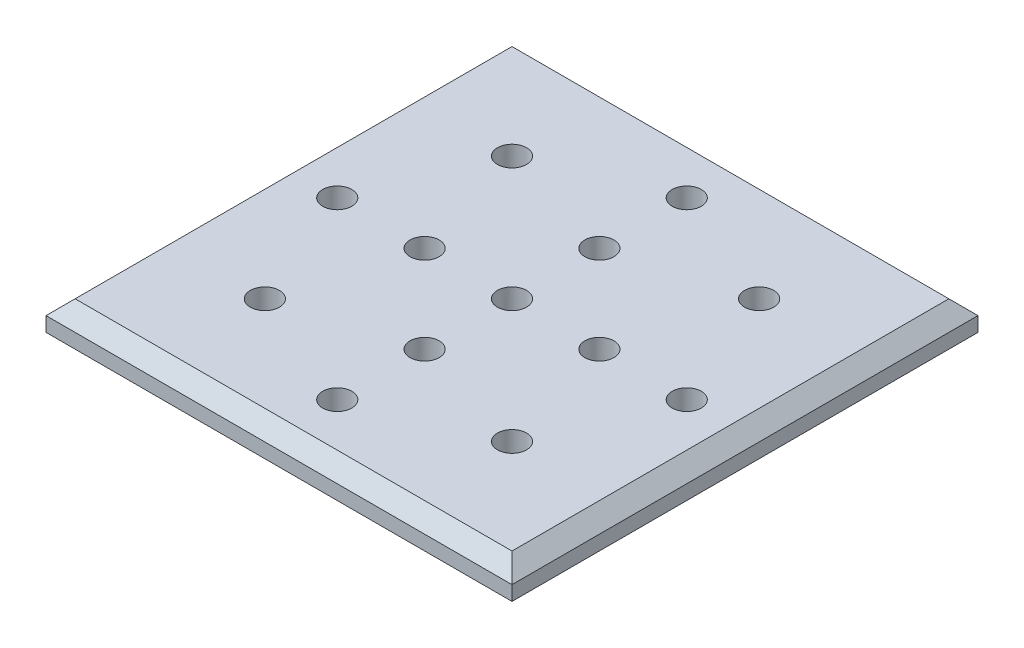
ISO-10303-21;
HEADER;
FILE_DESCRIPTION(('STEP AP214'),'2;1');
FILE_NAME('part.step','',(''),(''),'','','');
FILE_SCHEMA(('AUTOMOTIVE_DESIGN { 1 0 10303 214 1 1 1 1 }'));
ENDSEC;
DATA;
#1=APPLICATION_CONTEXT('core data for automotive mechanical design processes');
#2=APPLICATION_PROTOCOL_DEFINITION('international standard','automotive_design',2000,#1);
#3=PRODUCT_CONTEXT('',#1,'mechanical');
#4=PRODUCT('Part','Part','',(#3));
#5=PRODUCT_RELATED_PRODUCT_CATEGORY('part','',(#4));
#6=PRODUCT_DEFINITION_FORMATION('','',#4);
#7=PRODUCT_DEFINITION_CONTEXT('part definition',#1,'design');
#8=PRODUCT_DEFINITION('design','',#6,#7);
#9=PRODUCT_DEFINITION_SHAPE('','',#8);
#10=(LENGTH_UNIT() NAMED_UNIT(*) SI_UNIT(.MILLI.,.METRE.));
#11=(NAMED_UNIT(*) PLANE_ANGLE_UNIT() SI_UNIT($,.RADIAN.));
#12=(NAMED_UNIT(*) SI_UNIT($,.STERADIAN.) SOLID_ANGLE_UNIT());
#13=UNCERTAINTY_MEASURE_WITH_UNIT(LENGTH_MEASURE(1.E-05),#10,'distance_accuracy_value','');
#14=(GEOMETRIC_REPRESENTATION_CONTEXT(3) GLOBAL_UNCERTAINTY_ASSIGNED_CONTEXT((#13)) GLOBAL_UNIT_ASSIGNED_CONTEXT((#10,
#11,#12)) REPRESENTATION_CONTEXT('',''));
#15=CARTESIAN_POINT('',(0.,0.,0.));
#16=DIRECTION('',(0.,0.,1.));
#17=DIRECTION('',(1.,0.,0.));
#18=AXIS2_PLACEMENT_3D('',#15,#16,#17);
#19=CARTESIAN_POINT('',(50.8,9.525,50.8));
#20=DIRECTION('',(-1.,0.,0.));
#21=DIRECTION('',(0.,0.,1.));
#22=AXIS2_PLACEMENT_3D('',#19,#20,#21);
#23=PLANE('',#22);
#24=DIRECTION('',(0.,-1.,0.));
#25=VECTOR('',#24,1.);
#26=CARTESIAN_POINT('',(50.8,9.525,-50.8));
#27=LINE('',#26,#25);
#28=CARTESIAN_POINT('',(50.8,6.34999999999995,-50.8));
#29=VERTEX_POINT('',#28);
#30=CARTESIAN_POINT('',(50.8,3.175,-50.8));
#31=VERTEX_POINT('',#30);
#32=EDGE_CURVE('E176',#29,#31,#27,.T.);
#33=ORIENTED_EDGE('',*,*,#32,.F.);
#34=DIRECTION('',(0.,0.,1.));
#35=VECTOR('',#34,1.);
#36=CARTESIAN_POINT('',(50.8,6.34999999999995,50.8));
#37=LINE('',#36,#35);
#38=CARTESIAN_POINT('',(50.8,6.34999999999995,50.8));
#39=VERTEX_POINT('',#38);
#40=EDGE_CURVE('E11',#29,#39,#37,.T.);
#41=ORIENTED_EDGE('',*,*,#40,.T.);
#42=DIRECTION('',(0.,-1.,0.));
#43=VECTOR('',#42,1.);
#44=CARTESIAN_POINT('',(50.8,9.525,50.8));
#45=LINE('',#44,#43);
#46=CARTESIAN_POINT('',(50.8,3.175,50.8));
#47=VERTEX_POINT('',#46);
#48=EDGE_CURVE('E170',#39,#47,#45,.T.);
#49=ORIENTED_EDGE('',*,*,#48,.T.);
#50=DIRECTION('',(0.,0.,1.));
#51=VECTOR('',#50,1.);
#52=CARTESIAN_POINT('',(50.8,3.175,-50.8));
#53=LINE('',#52,#51);
#54=EDGE_CURVE('E161',#31,#47,#53,.T.);
#55=ORIENTED_EDGE('',*,*,#54,.F.);
#56=EDGE_LOOP('',(#33,#41,#49,#55));
#57=FACE_BOUND('',#56,.T.);
#58=ADVANCED_FACE('F33',(#57),#23,.F.);
#59=CARTESIAN_POINT('',(-50.8,9.525,-50.8));
#60=DIRECTION('',(0.,0.,1.));
#61=DIRECTION('',(1.,0.,0.));
#62=AXIS2_PLACEMENT_3D('',#59,#60,#61);
#63=PLANE('',#62);
#64=DIRECTION('',(0.,-1.,0.));
#65=VECTOR('',#64,1.);
#66=CARTESIAN_POINT('',(-50.8,9.525,-50.8));
#67=LINE('',#66,#65);
#68=CARTESIAN_POINT('',(-50.8,6.34999999999995,-50.8));
#69=VERTEX_POINT('',#68);
#70=CARTESIAN_POINT('',(-50.8,3.175,-50.8));
#71=VERTEX_POINT('',#70);
#72=EDGE_CURVE('E174',#69,#71,#67,.T.);
#73=ORIENTED_EDGE('',*,*,#72,.F.);
#74=DIRECTION('',(1.,0.,0.));
#75=VECTOR('',#74,1.);
#76=CARTESIAN_POINT('',(-50.8,6.34999999999995,-50.8));
#77=LINE('',#76,#75);
#78=EDGE_CURVE('E42',#69,#29,#77,.T.);
#79=ORIENTED_EDGE('',*,*,#78,.T.);
#80=ORIENTED_EDGE('',*,*,#32,.T.);
#81=DIRECTION('',(1.,0.,0.));
#82=VECTOR('',#81,1.);
#83=CARTESIAN_POINT('',(-50.8,3.175,-50.8));
#84=LINE('',#83,#82);
#85=EDGE_CURVE('E155',#71,#31,#84,.T.);
#86=ORIENTED_EDGE('',*,*,#85,.F.);
#87=EDGE_LOOP('',(#73,#79,#80,#86));
#88=FACE_BOUND('',#87,.T.);
#89=ADVANCED_FACE('F239',(#88),#63,.F.);
#90=CARTESIAN_POINT('',(-50.8,9.525,50.8));
#91=DIRECTION('',(1.,0.,0.));
#92=DIRECTION('',(0.,0.,-1.));
#93=AXIS2_PLACEMENT_3D('',#90,#91,#92);
#94=PLANE('',#93);
#95=DIRECTION('',(0.,-1.,0.));
#96=VECTOR('',#95,1.);
#97=CARTESIAN_POINT('',(-50.8,9.525,50.8));
#98=LINE('',#97,#96);
#99=CARTESIAN_POINT('',(-50.8,6.34999999999995,50.8));
#100=VERTEX_POINT('',#99);
#101=CARTESIAN_POINT('',(-50.8,3.175,50.8));
#102=VERTEX_POINT('',#101);
#103=EDGE_CURVE('E172',#100,#102,#98,.T.);
#104=ORIENTED_EDGE('',*,*,#103,.F.);
#105=DIRECTION('',(0.,0.,-1.));
#106=VECTOR('',#105,1.);
#107=CARTESIAN_POINT('',(-50.8,6.34999999999995,50.8));
#108=LINE('',#107,#106);
#109=EDGE_CURVE('E57',#100,#69,#108,.T.);
#110=ORIENTED_EDGE('',*,*,#109,.T.);
#111=ORIENTED_EDGE('',*,*,#72,.T.);
#112=DIRECTION('',(0.,0.,-1.));
#113=VECTOR('',#112,1.);
#114=CARTESIAN_POINT('',(-50.8,3.175,50.8));
#115=LINE('',#114,#113);
#116=EDGE_CURVE('E167',#102,#71,#115,.T.);
#117=ORIENTED_EDGE('',*,*,#116,.F.);
#118=EDGE_LOOP('',(#104,#110,#111,#117));
#119=FACE_BOUND('',#118,.T.);
#120=ADVANCED_FACE('F233',(#119),#94,.F.);
#121=CARTESIAN_POINT('',(-50.8,9.525,50.8));
#122=DIRECTION('',(0.,0.,-1.));
#123=DIRECTION('',(-1.,0.,0.));
#124=AXIS2_PLACEMENT_3D('',#121,#122,#123);
#125=PLANE('',#124);
#126=ORIENTED_EDGE('',*,*,#48,.F.);
#127=DIRECTION('',(-1.,0.,0.));
#128=VECTOR('',#127,1.);
#129=CARTESIAN_POINT('',(-50.8,6.34999999999995,50.8));
#130=LINE('',#129,#128);
#131=EDGE_CURVE('E187',#39,#100,#130,.T.);
#132=ORIENTED_EDGE('',*,*,#131,.T.);
#133=ORIENTED_EDGE('',*,*,#103,.T.);
#134=DIRECTION('',(-1.,0.,0.));
#135=VECTOR('',#134,1.);
#136=CARTESIAN_POINT('',(50.8,3.175,50.8));
#137=LINE('',#136,#135);
#138=EDGE_CURVE('E164',#47,#102,#137,.T.);
#139=ORIENTED_EDGE('',*,*,#138,.F.);
#140=EDGE_LOOP('',(#126,#132,#133,#139));
#141=FACE_BOUND('',#140,.T.);
#142=ADVANCED_FACE('F217',(#141),#125,.F.);
#143=CARTESIAN_POINT('',(0.,9.525,0.));
#144=DIRECTION('',(0.,-1.,0.));
#145=DIRECTION('',(0.,0.,-1.));
#146=AXIS2_PLACEMENT_3D('',#143,#144,#145);
#147=PLANE('',#146);
#148=CARTESIAN_POINT('',(0.,9.525,-19.05));
#149=DIRECTION('',(0.,-1.,0.));
#150=DIRECTION('',(0.,0.,-1.));
#151=AXIS2_PLACEMENT_3D('',#148,#149,#150);
#152=CIRCLE('',#151,3.175);
#153=CARTESIAN_POINT('',(0.,9.525,-22.225));
#154=VERTEX_POINT('',#153);
#155=EDGE_CURVE('E144',#154,#154,#152,.F.);
#156=ORIENTED_EDGE('',*,*,#155,.F.);
#157=EDGE_LOOP('',(#156));
#158=FACE_BOUND('',#157,.T.);
#159=CARTESIAN_POINT('',(26.9407683632074,9.525,26.9407683632075));
#160=DIRECTION('',(0.,-1.,0.));
#161=DIRECTION('',(0.,0.,-1.));
#162=AXIS2_PLACEMENT_3D('',#159,#160,#161);
#163=CIRCLE('',#162,3.175);
#164=CARTESIAN_POINT('',(26.9407683632074,9.525,23.7657683632075));
#165=VERTEX_POINT('',#164);
#166=EDGE_CURVE('E490',#165,#165,#163,.F.);
#167=ORIENTED_EDGE('',*,*,#166,.F.);
#168=EDGE_LOOP('',(#167));
#169=FACE_BOUND('',#168,.T.);
#170=CARTESIAN_POINT('',(0.,9.525,38.1));
#171=DIRECTION('',(0.,-1.,0.));
#172=DIRECTION('',(0.,0.,-1.));
#173=AXIS2_PLACEMENT_3D('',#170,#171,#172);
#174=CIRCLE('',#173,3.17499999999994);
#175=CARTESIAN_POINT('',(0.,9.525,34.9250000000001));
#176=VERTEX_POINT('',#175);
#177=EDGE_CURVE('E492',#176,#176,#174,.F.);
#178=ORIENTED_EDGE('',*,*,#177,.F.);
#179=EDGE_LOOP('',(#178));
#180=FACE_BOUND('',#179,.T.);
#181=CARTESIAN_POINT('',(-26.9407683632074,9.525,26.9407683632074));
#182=DIRECTION('',(0.,-1.,0.));
#183=DIRECTION('',(0.,0.,-1.));
#184=AXIS2_PLACEMENT_3D('',#181,#182,#183);
#185=CIRCLE('',#184,3.17500000000005);
#186=CARTESIAN_POINT('',(-26.9407683632074,9.525,23.7657683632073));
#187=VERTEX_POINT('',#186);
#188=EDGE_CURVE('E496',#187,#187,#185,.F.);
#189=ORIENTED_EDGE('',*,*,#188,.F.);
#190=EDGE_LOOP('',(#189));
#191=FACE_BOUND('',#190,.T.);
#192=CARTESIAN_POINT('',(-19.05,9.525,0.));
#193=DIRECTION('',(0.,-1.,0.));
#194=DIRECTION('',(0.,0.,-1.));
#195=AXIS2_PLACEMENT_3D('',#192,#193,#194);
#196=CIRCLE('',#195,3.175);
#197=CARTESIAN_POINT('',(-19.05,9.525,-3.175));
#198=VERTEX_POINT('',#197);
#199=EDGE_CURVE('E501',#198,#198,#196,.F.);
#200=ORIENTED_EDGE('',*,*,#199,.F.);
#201=EDGE_LOOP('',(#200));
#202=FACE_BOUND('',#201,.T.);
#203=CARTESIAN_POINT('',(0.,9.525,19.05));
#204=DIRECTION('',(0.,-1.,0.));
#205=DIRECTION('',(0.,0.,-1.));
#206=AXIS2_PLACEMENT_3D('',#203,#204,#205);
#207=CIRCLE('',#206,3.175);
#208=CARTESIAN_POINT('',(0.,9.525,15.875));
#209=VERTEX_POINT('',#208);
#210=EDGE_CURVE('E504',#209,#209,#207,.F.);
#211=ORIENTED_EDGE('',*,*,#210,.F.);
#212=EDGE_LOOP('',(#211));
#213=FACE_BOUND('',#212,.T.);
#214=CARTESIAN_POINT('',(38.1,9.525,0.));
#215=DIRECTION('',(0.,-1.,0.));
#216=DIRECTION('',(0.,0.,-1.));
#217=AXIS2_PLACEMENT_3D('',#214,#215,#216);
#218=CIRCLE('',#217,3.175);
#219=CARTESIAN_POINT('',(38.1,9.525,-3.175));
#220=VERTEX_POINT('',#219);
#221=EDGE_CURVE('E507',#220,#220,#218,.F.);
#222=ORIENTED_EDGE('',*,*,#221,.F.);
#223=EDGE_LOOP('',(#222));
#224=FACE_BOUND('',#223,.T.);
#225=CARTESIAN_POINT('',(19.05,9.525,0.));
#226=DIRECTION('',(0.,-1.,0.));
#227=DIRECTION('',(0.,0.,-1.));
#228=AXIS2_PLACEMENT_3D('',#225,#226,#227);
#229=CIRCLE('',#228,3.175);
#230=CARTESIAN_POINT('',(19.05,9.525,-3.175));
#231=VERTEX_POINT('',#230);
#232=EDGE_CURVE('E510',#231,#231,#229,.F.);
#233=ORIENTED_EDGE('',*,*,#232,.F.);
#234=EDGE_LOOP('',(#233));
#235=FACE_BOUND('',#234,.T.);
#236=CARTESIAN_POINT('',(-38.1,9.525,0.));
#237=DIRECTION('',(0.,-1.,0.));
#238=DIRECTION('',(0.,0.,-1.));
#239=AXIS2_PLACEMENT_3D('',#236,#237,#238);
#240=CIRCLE('',#239,3.1749999999999);
#241=CARTESIAN_POINT('',(-38.1,9.525,-3.1749999999999));
#242=VERTEX_POINT('',#241);
#243=EDGE_CURVE('E513',#242,#242,#240,.F.);
#244=ORIENTED_EDGE('',*,*,#243,.F.);
#245=EDGE_LOOP('',(#244));
#246=FACE_BOUND('',#245,.T.);
#247=CARTESIAN_POINT('',(-26.9407683632077,9.525,-26.9407683632075));
#248=DIRECTION('',(0.,-1.,0.));
#249=DIRECTION('',(0.,0.,-1.));
#250=AXIS2_PLACEMENT_3D('',#247,#248,#249);
#251=CIRCLE('',#250,3.17499999999972);
#252=CARTESIAN_POINT('',(-26.9407683632077,9.525,-30.1157683632072));
#253=VERTEX_POINT('',#252);
#254=EDGE_CURVE('E516',#253,#253,#251,.F.);
#255=ORIENTED_EDGE('',*,*,#254,.F.);
#256=EDGE_LOOP('',(#255));
#257=FACE_BOUND('',#256,.T.);
#258=CARTESIAN_POINT('',(-3.82545595598378E-13,9.525,-38.1000000000002));
#259=DIRECTION('',(0.,-1.,0.));
#260=DIRECTION('',(0.,0.,-1.));
#261=AXIS2_PLACEMENT_3D('',#258,#259,#260);
#262=CIRCLE('',#261,3.1749999999996);
#263=CARTESIAN_POINT('',(-3.82545595598378E-13,9.525,-41.2749999999998));
#264=VERTEX_POINT('',#263);
#265=EDGE_CURVE('E519',#264,#264,#262,.F.);
#266=ORIENTED_EDGE('',*,*,#265,.F.);
#267=EDGE_LOOP('',(#266));
#268=FACE_BOUND('',#267,.T.);
#269=CARTESIAN_POINT('',(26.9407683632071,9.525,-26.940768363208));
#270=DIRECTION('',(0.,-1.,0.));
#271=DIRECTION('',(0.,0.,-1.));
#272=AXIS2_PLACEMENT_3D('',#269,#270,#271);
#273=CIRCLE('',#272,3.17499999999958);
#274=CARTESIAN_POINT('',(26.9407683632071,9.525,-30.1157683632075));
#275=VERTEX_POINT('',#274);
#276=EDGE_CURVE('E522',#275,#275,#273,.F.);
#277=ORIENTED_EDGE('',*,*,#276,.F.);
#278=EDGE_LOOP('',(#277));
#279=FACE_BOUND('',#278,.T.);
#280=CARTESIAN_POINT('',(0.,9.525,0.));
#281=DIRECTION('',(0.,-1.,0.));
#282=DIRECTION('',(0.,0.,-1.));
#283=AXIS2_PLACEMENT_3D('',#280,#281,#282);
#284=CIRCLE('',#283,3.175);
#285=CARTESIAN_POINT('',(0.,9.525,-3.175));
#286=VERTEX_POINT('',#285);
#287=EDGE_CURVE('E525',#286,#286,#284,.F.);
#288=ORIENTED_EDGE('',*,*,#287,.F.);
#289=EDGE_LOOP('',(#288));
#290=FACE_BOUND('',#289,.T.);
#291=DIRECTION('',(0.,0.,1.));
#292=VECTOR('',#291,1.);
#293=CARTESIAN_POINT('',(-47.625,9.525,0.));
#294=LINE('',#293,#292);
#295=CARTESIAN_POINT('',(-47.625,9.525,-47.625));
#296=VERTEX_POINT('',#295);
#297=CARTESIAN_POINT('',(-47.625,9.525,47.625));
#298=VERTEX_POINT('',#297);
#299=EDGE_CURVE('E182',#296,#298,#294,.T.);
#300=ORIENTED_EDGE('',*,*,#299,.T.);
#301=DIRECTION('',(1.,0.,0.));
#302=VECTOR('',#301,1.);
#303=CARTESIAN_POINT('',(0.,9.525,47.625));
#304=LINE('',#303,#302);
#305=CARTESIAN_POINT('',(47.625,9.525,47.625));
#306=VERTEX_POINT('',#305);
#307=EDGE_CURVE('E184',#298,#306,#304,.T.);
#308=ORIENTED_EDGE('',*,*,#307,.T.);
#309=DIRECTION('',(0.,0.,-1.));
#310=VECTOR('',#309,1.);
#311=CARTESIAN_POINT('',(47.625,9.525,0.));
#312=LINE('',#311,#310);
#313=CARTESIAN_POINT('',(47.625,9.525,-47.625));
#314=VERTEX_POINT('',#313);
#315=EDGE_CURVE('E178',#306,#314,#312,.T.);
#316=ORIENTED_EDGE('',*,*,#315,.T.);
#317=DIRECTION('',(-1.,0.,0.));
#318=VECTOR('',#317,1.);
#319=CARTESIAN_POINT('',(0.,9.525,-47.625));
#320=LINE('',#319,#318);
#321=EDGE_CURVE('E180',#314,#296,#320,.T.);
#322=ORIENTED_EDGE('',*,*,#321,.T.);
#323=EDGE_LOOP('',(#300,#308,#316,#322));
#324=FACE_BOUND('',#323,.T.);
#325=ADVANCED_FACE('F222',(#158,#169,#180,#191,#202,#213,#224,#235,#246,#257,#268,#279,#290,
#324),#147,.F.);
#326=CARTESIAN_POINT('',(0.,3.175,0.));
#327=DIRECTION('',(0.,-1.,0.));
#328=DIRECTION('',(0.,0.,-1.));
#329=AXIS2_PLACEMENT_3D('',#326,#327,#328);
#330=PLANE('',#329);
#331=DIRECTION('',(1.,0.,0.));
#332=VECTOR('',#331,1.);
#333=CARTESIAN_POINT('',(-47.498,3.175,-47.498));
#334=LINE('',#333,#332);
#335=CARTESIAN_POINT('',(-47.498,3.175,-47.498));
#336=VERTEX_POINT('',#335);
#337=CARTESIAN_POINT('',(47.498,3.175,-47.498));
#338=VERTEX_POINT('',#337);
#339=EDGE_CURVE('E123',#336,#338,#334,.T.);
#340=ORIENTED_EDGE('',*,*,#339,.F.);
#341=DIRECTION('',(0.,0.,-1.));
#342=VECTOR('',#341,1.);
#343=CARTESIAN_POINT('',(-47.498,3.175,47.498));
#344=LINE('',#343,#342);
#345=CARTESIAN_POINT('',(-47.498,3.175,47.498));
#346=VERTEX_POINT('',#345);
#347=EDGE_CURVE('E133',#346,#336,#344,.T.);
#348=ORIENTED_EDGE('',*,*,#347,.F.);
#349=DIRECTION('',(-1.,0.,0.));
#350=VECTOR('',#349,1.);
#351=CARTESIAN_POINT('',(47.498,3.175,47.498));
#352=LINE('',#351,#350);
#353=CARTESIAN_POINT('',(47.498,3.175,47.498));
#354=VERTEX_POINT('',#353);
#355=EDGE_CURVE('E115',#354,#346,#352,.T.);
#356=ORIENTED_EDGE('',*,*,#355,.F.);
#357=DIRECTION('',(0.,0.,1.));
#358=VECTOR('',#357,1.);
#359=CARTESIAN_POINT('',(47.498,3.175,-47.498));
#360=LINE('',#359,#358);
#361=EDGE_CURVE('E130',#338,#354,#360,.T.);
#362=ORIENTED_EDGE('',*,*,#361,.F.);
#363=EDGE_LOOP('',(#340,#348,#356,#362));
#364=FACE_BOUND('',#363,.T.);
#365=ORIENTED_EDGE('',*,*,#85,.T.);
#366=ORIENTED_EDGE('',*,*,#54,.T.);
#367=ORIENTED_EDGE('',*,*,#138,.T.);
#368=ORIENTED_EDGE('',*,*,#116,.T.);
#369=EDGE_LOOP('',(#365,#366,#367,#368));
#370=FACE_BOUND('',#369,.T.);
#371=ADVANCED_FACE('F128',(#364,#370),#330,.T.);
#372=CARTESIAN_POINT('',(47.498,3.175,-47.498));
#373=DIRECTION('',(1.,0.,0.));
#374=DIRECTION('',(0.,0.,-1.));
#375=AXIS2_PLACEMENT_3D('',#372,#373,#374);
#376=PLANE('',#375);
#377=DIRECTION('',(0.,0.,1.));
#378=VECTOR('',#377,1.);
#379=CARTESIAN_POINT('',(47.498,0.,-47.498));
#380=LINE('',#379,#378);
#381=CARTESIAN_POINT('',(47.498,0.,-47.498));
#382=VERTEX_POINT('',#381);
#383=CARTESIAN_POINT('',(47.498,0.,47.498));
#384=VERTEX_POINT('',#383);
#385=EDGE_CURVE('E149',#382,#384,#380,.T.);
#386=ORIENTED_EDGE('',*,*,#385,.F.);
#387=DIRECTION('',(0.,-1.,0.));
#388=VECTOR('',#387,1.);
#389=CARTESIAN_POINT('',(47.498,3.175,-47.498));
#390=LINE('',#389,#388);
#391=EDGE_CURVE('E137',#338,#382,#390,.T.);
#392=ORIENTED_EDGE('',*,*,#391,.F.);
#393=ORIENTED_EDGE('',*,*,#361,.T.);
#394=DIRECTION('',(0.,-1.,0.));
#395=VECTOR('',#394,1.);
#396=CARTESIAN_POINT('',(47.498,3.175,47.498));
#397=LINE('',#396,#395);
#398=EDGE_CURVE('E111',#354,#384,#397,.T.);
#399=ORIENTED_EDGE('',*,*,#398,.T.);
#400=EDGE_LOOP('',(#386,#392,#393,#399));
#401=FACE_BOUND('',#400,.T.);
#402=ADVANCED_FACE('F136',(#401),#376,.T.);
#403=CARTESIAN_POINT('',(-47.498,3.175,-47.498));
#404=DIRECTION('',(0.,0.,-1.));
#405=DIRECTION('',(-1.,0.,0.));
#406=AXIS2_PLACEMENT_3D('',#403,#404,#405);
#407=PLANE('',#406);
#408=DIRECTION('',(1.,0.,0.));
#409=VECTOR('',#408,1.);
#410=CARTESIAN_POINT('',(-47.498,0.,-47.498));
#411=LINE('',#410,#409);
#412=CARTESIAN_POINT('',(-47.498,0.,-47.498));
#413=VERTEX_POINT('',#412);
#414=EDGE_CURVE('E138',#413,#382,#411,.T.);
#415=ORIENTED_EDGE('',*,*,#414,.F.);
#416=DIRECTION('',(0.,-1.,0.));
#417=VECTOR('',#416,1.);
#418=CARTESIAN_POINT('',(-47.498,3.175,-47.498));
#419=LINE('',#418,#417);
#420=EDGE_CURVE('E156',#336,#413,#419,.T.);
#421=ORIENTED_EDGE('',*,*,#420,.F.);
#422=ORIENTED_EDGE('',*,*,#339,.T.);
#423=ORIENTED_EDGE('',*,*,#391,.T.);
#424=EDGE_LOOP('',(#415,#421,#422,#423));
#425=FACE_BOUND('',#424,.T.);
#426=ADVANCED_FACE('F293',(#425),#407,.T.);
#427=CARTESIAN_POINT('',(-47.498,3.175,47.498));
#428=DIRECTION('',(-1.,0.,0.));
#429=DIRECTION('',(0.,0.,1.));
#430=AXIS2_PLACEMENT_3D('',#427,#428,#429);
#431=PLANE('',#430);
#432=DIRECTION('',(0.,0.,-1.));
#433=VECTOR('',#432,1.);
#434=CARTESIAN_POINT('',(-47.498,0.,47.498));
#435=LINE('',#434,#433);
#436=CARTESIAN_POINT('',(-47.498,0.,47.498));
#437=VERTEX_POINT('',#436);
#438=EDGE_CURVE('E141',#437,#413,#435,.T.);
#439=ORIENTED_EDGE('',*,*,#438,.F.);
#440=DIRECTION('',(0.,-1.,0.));
#441=VECTOR('',#440,1.);
#442=CARTESIAN_POINT('',(-47.498,3.175,47.498));
#443=LINE('',#442,#441);
#444=EDGE_CURVE('E122',#346,#437,#443,.T.);
#445=ORIENTED_EDGE('',*,*,#444,.F.);
#446=ORIENTED_EDGE('',*,*,#347,.T.);
#447=ORIENTED_EDGE('',*,*,#420,.T.);
#448=EDGE_LOOP('',(#439,#445,#446,#447));
#449=FACE_BOUND('',#448,.T.);
#450=ADVANCED_FACE('F263',(#449),#431,.T.);
#451=CARTESIAN_POINT('',(47.498,3.175,47.498));
#452=DIRECTION('',(0.,0.,1.));
#453=DIRECTION('',(1.,0.,0.));
#454=AXIS2_PLACEMENT_3D('',#451,#452,#453);
#455=PLANE('',#454);
#456=DIRECTION('',(-1.,0.,0.));
#457=VECTOR('',#456,1.);
#458=CARTESIAN_POINT('',(47.498,0.,47.498));
#459=LINE('',#458,#457);
#460=EDGE_CURVE('E117',#384,#437,#459,.T.);
#461=ORIENTED_EDGE('',*,*,#460,.F.);
#462=ORIENTED_EDGE('',*,*,#398,.F.);
#463=ORIENTED_EDGE('',*,*,#355,.T.);
#464=ORIENTED_EDGE('',*,*,#444,.T.);
#465=EDGE_LOOP('',(#461,#462,#463,#464));
#466=FACE_BOUND('',#465,.T.);
#467=ADVANCED_FACE('F113',(#466),#455,.T.);
#468=CARTESIAN_POINT('',(0.,0.,0.));
#469=DIRECTION('',(0.,-1.,0.));
#470=DIRECTION('',(0.,0.,-1.));
#471=AXIS2_PLACEMENT_3D('',#468,#469,#470);
#472=PLANE('',#471);
#473=CARTESIAN_POINT('',(0.,0.,-19.05));
#474=DIRECTION('',(0.,1.,0.));
#475=DIRECTION('',(0.,0.,1.));
#476=AXIS2_PLACEMENT_3D('',#473,#474,#475);
#477=CIRCLE('',#476,3.175);
#478=CARTESIAN_POINT('',(0.,0.,-15.875));
#479=VERTEX_POINT('',#478);
#480=EDGE_CURVE('E488',#479,#479,#477,.T.);
#481=ORIENTED_EDGE('',*,*,#480,.T.);
#482=EDGE_LOOP('',(#481));
#483=FACE_BOUND('',#482,.T.);
#484=CARTESIAN_POINT('',(26.9407683632074,0.,26.9407683632075));
#485=DIRECTION('',(0.,1.,0.));
#486=DIRECTION('',(0.,0.,1.));
#487=AXIS2_PLACEMENT_3D('',#484,#485,#486);
#488=CIRCLE('',#487,3.175);
#489=CARTESIAN_POINT('',(26.9407683632074,0.,30.1157683632075));
#490=VERTEX_POINT('',#489);
#491=EDGE_CURVE('E543',#490,#490,#488,.T.);
#492=ORIENTED_EDGE('',*,*,#491,.T.);
#493=EDGE_LOOP('',(#492));
#494=FACE_BOUND('',#493,.T.);
#495=CARTESIAN_POINT('',(0.,0.,38.1));
#496=DIRECTION('',(0.,1.,0.));
#497=DIRECTION('',(0.,0.,1.));
#498=AXIS2_PLACEMENT_3D('',#495,#496,#497);
#499=CIRCLE('',#498,3.17499999999994);
#500=CARTESIAN_POINT('',(0.,0.,41.275));
#501=VERTEX_POINT('',#500);
#502=EDGE_CURVE('E546',#501,#501,#499,.T.);
#503=ORIENTED_EDGE('',*,*,#502,.T.);
#504=EDGE_LOOP('',(#503));
#505=FACE_BOUND('',#504,.T.);
#506=CARTESIAN_POINT('',(-26.9407683632074,0.,26.9407683632074));
#507=DIRECTION('',(0.,1.,0.));
#508=DIRECTION('',(0.,0.,1.));
#509=AXIS2_PLACEMENT_3D('',#506,#507,#508);
#510=CIRCLE('',#509,3.17500000000005);
#511=CARTESIAN_POINT('',(-26.9407683632074,0.,30.1157683632074));
#512=VERTEX_POINT('',#511);
#513=EDGE_CURVE('E548',#512,#512,#510,.T.);
#514=ORIENTED_EDGE('',*,*,#513,.T.);
#515=EDGE_LOOP('',(#514));
#516=FACE_BOUND('',#515,.T.);
#517=CARTESIAN_POINT('',(-19.05,0.,0.));
#518=DIRECTION('',(0.,1.,0.));
#519=DIRECTION('',(0.,0.,1.));
#520=AXIS2_PLACEMENT_3D('',#517,#518,#519);
#521=CIRCLE('',#520,3.175);
#522=CARTESIAN_POINT('',(-19.05,0.,3.175));
#523=VERTEX_POINT('',#522);
#524=EDGE_CURVE('E532',#523,#523,#521,.T.);
#525=ORIENTED_EDGE('',*,*,#524,.T.);
#526=EDGE_LOOP('',(#525));
#527=FACE_BOUND('',#526,.T.);
#528=CARTESIAN_POINT('',(0.,0.,19.05));
#529=DIRECTION('',(0.,1.,0.));
#530=DIRECTION('',(0.,0.,1.));
#531=AXIS2_PLACEMENT_3D('',#528,#529,#530);
#532=CIRCLE('',#531,3.175);
#533=CARTESIAN_POINT('',(0.,0.,22.225));
#534=VERTEX_POINT('',#533);
#535=EDGE_CURVE('E535',#534,#534,#532,.T.);
#536=ORIENTED_EDGE('',*,*,#535,.T.);
#537=EDGE_LOOP('',(#536));
#538=FACE_BOUND('',#537,.T.);
#539=CARTESIAN_POINT('',(38.1,0.,0.));
#540=DIRECTION('',(0.,1.,0.));
#541=DIRECTION('',(0.,0.,1.));
#542=AXIS2_PLACEMENT_3D('',#539,#540,#541);
#543=CIRCLE('',#542,3.175);
#544=CARTESIAN_POINT('',(38.1,0.,3.175));
#545=VERTEX_POINT('',#544);
#546=EDGE_CURVE('E538',#545,#545,#543,.T.);
#547=ORIENTED_EDGE('',*,*,#546,.T.);
#548=EDGE_LOOP('',(#547));
#549=FACE_BOUND('',#548,.T.);
#550=CARTESIAN_POINT('',(19.05,0.,0.));
#551=DIRECTION('',(0.,1.,0.));
#552=DIRECTION('',(0.,0.,1.));
#553=AXIS2_PLACEMENT_3D('',#550,#551,#552);
#554=CIRCLE('',#553,3.175);
#555=CARTESIAN_POINT('',(19.05,0.,3.175));
#556=VERTEX_POINT('',#555);
#557=EDGE_CURVE('E531',#556,#556,#554,.T.);
#558=ORIENTED_EDGE('',*,*,#557,.T.);
#559=EDGE_LOOP('',(#558));
#560=FACE_BOUND('',#559,.T.);
#561=CARTESIAN_POINT('',(-38.1,0.,0.));
#562=DIRECTION('',(0.,1.,0.));
#563=DIRECTION('',(0.,0.,1.));
#564=AXIS2_PLACEMENT_3D('',#561,#562,#563);
#565=CIRCLE('',#564,3.1749999999999);
#566=CARTESIAN_POINT('',(-38.1,0.,3.1749999999999));
#567=VERTEX_POINT('',#566);
#568=EDGE_CURVE('E551',#567,#567,#565,.T.);
#569=ORIENTED_EDGE('',*,*,#568,.T.);
#570=EDGE_LOOP('',(#569));
#571=FACE_BOUND('',#570,.T.);
#572=CARTESIAN_POINT('',(-26.9407683632077,0.,-26.9407683632075));
#573=DIRECTION('',(0.,1.,0.));
#574=DIRECTION('',(0.,0.,1.));
#575=AXIS2_PLACEMENT_3D('',#572,#573,#574);
#576=CIRCLE('',#575,3.17499999999972);
#577=CARTESIAN_POINT('',(-26.9407683632077,0.,-23.7657683632077));
#578=VERTEX_POINT('',#577);
#579=EDGE_CURVE('E560',#578,#578,#576,.T.);
#580=ORIENTED_EDGE('',*,*,#579,.T.);
#581=EDGE_LOOP('',(#580));
#582=FACE_BOUND('',#581,.T.);
#583=CARTESIAN_POINT('',(-3.82545595598378E-13,0.,-38.1000000000002));
#584=DIRECTION('',(0.,1.,0.));
#585=DIRECTION('',(0.,0.,1.));
#586=AXIS2_PLACEMENT_3D('',#583,#584,#585);
#587=CIRCLE('',#586,3.1749999999996);
#588=CARTESIAN_POINT('',(-3.82545595598378E-13,0.,-34.9250000000006));
#589=VERTEX_POINT('',#588);
#590=EDGE_CURVE('E557',#589,#589,#587,.T.);
#591=ORIENTED_EDGE('',*,*,#590,.T.);
#592=EDGE_LOOP('',(#591));
#593=FACE_BOUND('',#592,.T.);
#594=CARTESIAN_POINT('',(26.9407683632071,0.,-26.940768363208));
#595=DIRECTION('',(0.,1.,0.));
#596=DIRECTION('',(0.,0.,1.));
#597=AXIS2_PLACEMENT_3D('',#594,#595,#596);
#598=CIRCLE('',#597,3.17499999999958);
#599=CARTESIAN_POINT('',(26.9407683632071,0.,-23.7657683632084));
#600=VERTEX_POINT('',#599);
#601=EDGE_CURVE('E554',#600,#600,#598,.T.);
#602=ORIENTED_EDGE('',*,*,#601,.T.);
#603=EDGE_LOOP('',(#602));
#604=FACE_BOUND('',#603,.T.);
#605=CARTESIAN_POINT('',(0.,0.,0.));
#606=DIRECTION('',(0.,1.,0.));
#607=DIRECTION('',(0.,0.,1.));
#608=AXIS2_PLACEMENT_3D('',#605,#606,#607);
#609=CIRCLE('',#608,3.175);
#610=CARTESIAN_POINT('',(0.,0.,3.175));
#611=VERTEX_POINT('',#610);
#612=EDGE_CURVE('E528',#611,#611,#609,.T.);
#613=ORIENTED_EDGE('',*,*,#612,.T.);
#614=EDGE_LOOP('',(#613));
#615=FACE_BOUND('',#614,.T.);
#616=ORIENTED_EDGE('',*,*,#414,.T.);
#617=ORIENTED_EDGE('',*,*,#385,.T.);
#618=ORIENTED_EDGE('',*,*,#460,.T.);
#619=ORIENTED_EDGE('',*,*,#438,.T.);
#620=EDGE_LOOP('',(#616,#617,#618,#619));
#621=FACE_BOUND('',#620,.T.);
#622=ADVANCED_FACE('F255',(#483,#494,#505,#516,#527,#538,#549,#560,#571,#582,#593,#604,#615,
#621),#472,.T.);
#623=CARTESIAN_POINT('',(0.,9.525,-47.625));
#624=DIRECTION('',(0.,-0.707106781186546,0.707106781186549));
#625=DIRECTION('',(-1.,0.,0.));
#626=AXIS2_PLACEMENT_3D('',#623,#624,#625);
#627=PLANE('',#626);
#628=DIRECTION('',(-0.577350269189625,0.577350269189628,0.577350269189625));
#629=VECTOR('',#628,1.);
#630=CARTESIAN_POINT('',(31.75,25.4,-31.75));
#631=LINE('',#630,#629);
#632=EDGE_CURVE('E195',#29,#314,#631,.T.);
#633=ORIENTED_EDGE('',*,*,#632,.F.);
#634=ORIENTED_EDGE('',*,*,#78,.F.);
#635=DIRECTION('',(0.577350269189625,0.577350269189628,0.577350269189625));
#636=VECTOR('',#635,1.);
#637=CARTESIAN_POINT('',(-31.75,25.4,-31.75));
#638=LINE('',#637,#636);
#639=EDGE_CURVE('E37',#296,#69,#638,.F.);
#640=ORIENTED_EDGE('',*,*,#639,.F.);
#641=ORIENTED_EDGE('',*,*,#321,.F.);
#642=EDGE_LOOP('',(#633,#634,#640,#641));
#643=FACE_BOUND('',#642,.T.);
#644=ADVANCED_FACE('F35',(#643),#627,.F.);
#645=CARTESIAN_POINT('',(-47.625,9.525,0.));
#646=DIRECTION('',(0.707106781186549,-0.707106781186546,0.));
#647=DIRECTION('',(0.,0.,1.));
#648=AXIS2_PLACEMENT_3D('',#645,#646,#647);
#649=PLANE('',#648);
#650=ORIENTED_EDGE('',*,*,#639,.T.);
#651=ORIENTED_EDGE('',*,*,#109,.F.);
#652=DIRECTION('',(0.577350269189625,0.577350269189628,-0.577350269189625));
#653=VECTOR('',#652,1.);
#654=CARTESIAN_POINT('',(-31.75,25.4,31.75));
#655=LINE('',#654,#653);
#656=EDGE_CURVE('E194',#298,#100,#655,.F.);
#657=ORIENTED_EDGE('',*,*,#656,.F.);
#658=ORIENTED_EDGE('',*,*,#299,.F.);
#659=EDGE_LOOP('',(#650,#651,#657,#658));
#660=FACE_BOUND('',#659,.T.);
#661=ADVANCED_FACE('F205',(#660),#649,.F.);
#662=CARTESIAN_POINT('',(47.625,9.525,0.));
#663=DIRECTION('',(-0.707106781186549,-0.707106781186546,0.));
#664=DIRECTION('',(0.,0.,-1.));
#665=AXIS2_PLACEMENT_3D('',#662,#663,#664);
#666=PLANE('',#665);
#667=ORIENTED_EDGE('',*,*,#632,.T.);
#668=ORIENTED_EDGE('',*,*,#315,.F.);
#669=DIRECTION('',(0.577350269189625,-0.577350269189628,0.577350269189625));
#670=VECTOR('',#669,1.);
#671=CARTESIAN_POINT('',(31.75,25.4,31.75));
#672=LINE('',#671,#670);
#673=EDGE_CURVE('E192',#39,#306,#672,.F.);
#674=ORIENTED_EDGE('',*,*,#673,.F.);
#675=ORIENTED_EDGE('',*,*,#40,.F.);
#676=EDGE_LOOP('',(#667,#668,#674,#675));
#677=FACE_BOUND('',#676,.T.);
#678=ADVANCED_FACE('F210',(#677),#666,.F.);
#679=CARTESIAN_POINT('',(0.,9.525,47.625));
#680=DIRECTION('',(0.,-0.707106781186546,-0.707106781186549));
#681=DIRECTION('',(1.,0.,0.));
#682=AXIS2_PLACEMENT_3D('',#679,#680,#681);
#683=PLANE('',#682);
#684=ORIENTED_EDGE('',*,*,#656,.T.);
#685=ORIENTED_EDGE('',*,*,#131,.F.);
#686=ORIENTED_EDGE('',*,*,#673,.T.);
#687=ORIENTED_EDGE('',*,*,#307,.F.);
#688=EDGE_LOOP('',(#684,#685,#686,#687));
#689=FACE_BOUND('',#688,.T.);
#690=ADVANCED_FACE('F219',(#689),#683,.F.);
#691=CARTESIAN_POINT('',(0.,55.118,0.));
#692=DIRECTION('',(0.,-1.,0.));
#693=DIRECTION('',(0.,0.,-1.));
#694=AXIS2_PLACEMENT_3D('',#691,#692,#693);
#695=CYLINDRICAL_SURFACE('',#694,3.175);
#696=ORIENTED_EDGE('',*,*,#612,.F.);
#697=EDGE_LOOP('',(#696));
#698=FACE_BOUND('',#697,.T.);
#699=ORIENTED_EDGE('',*,*,#287,.T.);
#700=EDGE_LOOP('',(#699));
#701=FACE_BOUND('',#700,.T.);
#702=ADVANCED_FACE('F249',(#698,#701),#695,.F.);
#703=CARTESIAN_POINT('',(26.9407683632071,55.118,-26.940768363208));
#704=DIRECTION('',(0.,-1.,0.));
#705=DIRECTION('',(0.,0.,-1.));
#706=AXIS2_PLACEMENT_3D('',#703,#704,#705);
#707=CYLINDRICAL_SURFACE('',#706,3.17499999999958);
#708=ORIENTED_EDGE('',*,*,#601,.F.);
#709=EDGE_LOOP('',(#708));
#710=FACE_BOUND('',#709,.T.);
#711=ORIENTED_EDGE('',*,*,#276,.T.);
#712=EDGE_LOOP('',(#711));
#713=FACE_BOUND('',#712,.T.);
#714=ADVANCED_FACE('F361',(#710,#713),#707,.F.);
#715=CARTESIAN_POINT('',(-3.82545595598378E-13,55.118,-38.1000000000002));
#716=DIRECTION('',(0.,-1.,0.));
#717=DIRECTION('',(0.,0.,-1.));
#718=AXIS2_PLACEMENT_3D('',#715,#716,#717);
#719=CYLINDRICAL_SURFACE('',#718,3.1749999999996);
#720=ORIENTED_EDGE('',*,*,#590,.F.);
#721=EDGE_LOOP('',(#720));
#722=FACE_BOUND('',#721,.T.);
#723=ORIENTED_EDGE('',*,*,#265,.T.);
#724=EDGE_LOOP('',(#723));
#725=FACE_BOUND('',#724,.T.);
#726=ADVANCED_FACE('F370',(#722,#725),#719,.F.);
#727=CARTESIAN_POINT('',(-26.9407683632077,55.118,-26.9407683632075));
#728=DIRECTION('',(0.,-1.,0.));
#729=DIRECTION('',(0.,0.,-1.));
#730=AXIS2_PLACEMENT_3D('',#727,#728,#729);
#731=CYLINDRICAL_SURFACE('',#730,3.17499999999972);
#732=ORIENTED_EDGE('',*,*,#579,.F.);
#733=EDGE_LOOP('',(#732));
#734=FACE_BOUND('',#733,.T.);
#735=ORIENTED_EDGE('',*,*,#254,.T.);
#736=EDGE_LOOP('',(#735));
#737=FACE_BOUND('',#736,.T.);
#738=ADVANCED_FACE('F379',(#734,#737),#731,.F.);
#739=CARTESIAN_POINT('',(-38.1,55.118,0.));
#740=DIRECTION('',(0.,-1.,0.));
#741=DIRECTION('',(0.,0.,-1.));
#742=AXIS2_PLACEMENT_3D('',#739,#740,#741);
#743=CYLINDRICAL_SURFACE('',#742,3.1749999999999);
#744=ORIENTED_EDGE('',*,*,#568,.F.);
#745=EDGE_LOOP('',(#744));
#746=FACE_BOUND('',#745,.T.);
#747=ORIENTED_EDGE('',*,*,#243,.T.);
#748=EDGE_LOOP('',(#747));
#749=FACE_BOUND('',#748,.T.);
#750=ADVANCED_FACE('F388',(#746,#749),#743,.F.);
#751=CARTESIAN_POINT('',(19.05,55.118,0.));
#752=DIRECTION('',(0.,-1.,0.));
#753=DIRECTION('',(0.,0.,-1.));
#754=AXIS2_PLACEMENT_3D('',#751,#752,#753);
#755=CYLINDRICAL_SURFACE('',#754,3.175);
#756=ORIENTED_EDGE('',*,*,#557,.F.);
#757=EDGE_LOOP('',(#756));
#758=FACE_BOUND('',#757,.T.);
#759=ORIENTED_EDGE('',*,*,#232,.T.);
#760=EDGE_LOOP('',(#759));
#761=FACE_BOUND('',#760,.T.);
#762=ADVANCED_FACE('F397',(#758,#761),#755,.F.);
#763=CARTESIAN_POINT('',(38.1,55.118,0.));
#764=DIRECTION('',(0.,-1.,0.));
#765=DIRECTION('',(0.,0.,-1.));
#766=AXIS2_PLACEMENT_3D('',#763,#764,#765);
#767=CYLINDRICAL_SURFACE('',#766,3.175);
#768=ORIENTED_EDGE('',*,*,#546,.F.);
#769=EDGE_LOOP('',(#768));
#770=FACE_BOUND('',#769,.T.);
#771=ORIENTED_EDGE('',*,*,#221,.T.);
#772=EDGE_LOOP('',(#771));
#773=FACE_BOUND('',#772,.T.);
#774=ADVANCED_FACE('F406',(#770,#773),#767,.F.);
#775=CARTESIAN_POINT('',(0.,55.118,19.05));
#776=DIRECTION('',(0.,-1.,0.));
#777=DIRECTION('',(0.,0.,-1.));
#778=AXIS2_PLACEMENT_3D('',#775,#776,#777);
#779=CYLINDRICAL_SURFACE('',#778,3.175);
#780=ORIENTED_EDGE('',*,*,#535,.F.);
#781=EDGE_LOOP('',(#780));
#782=FACE_BOUND('',#781,.T.);
#783=ORIENTED_EDGE('',*,*,#210,.T.);
#784=EDGE_LOOP('',(#783));
#785=FACE_BOUND('',#784,.T.);
#786=ADVANCED_FACE('F415',(#782,#785),#779,.F.);
#787=CARTESIAN_POINT('',(-19.05,55.118,0.));
#788=DIRECTION('',(0.,-1.,0.));
#789=DIRECTION('',(0.,0.,-1.));
#790=AXIS2_PLACEMENT_3D('',#787,#788,#789);
#791=CYLINDRICAL_SURFACE('',#790,3.175);
#792=ORIENTED_EDGE('',*,*,#524,.F.);
#793=EDGE_LOOP('',(#792));
#794=FACE_BOUND('',#793,.T.);
#795=ORIENTED_EDGE('',*,*,#199,.T.);
#796=EDGE_LOOP('',(#795));
#797=FACE_BOUND('',#796,.T.);
#798=ADVANCED_FACE('F424',(#794,#797),#791,.F.);
#799=CARTESIAN_POINT('',(-26.9407683632074,55.118,26.9407683632074));
#800=DIRECTION('',(0.,-1.,0.));
#801=DIRECTION('',(0.,0.,-1.));
#802=AXIS2_PLACEMENT_3D('',#799,#800,#801);
#803=CYLINDRICAL_SURFACE('',#802,3.17500000000005);
#804=ORIENTED_EDGE('',*,*,#513,.F.);
#805=EDGE_LOOP('',(#804));
#806=FACE_BOUND('',#805,.T.);
#807=ORIENTED_EDGE('',*,*,#188,.T.);
#808=EDGE_LOOP('',(#807));
#809=FACE_BOUND('',#808,.T.);
#810=ADVANCED_FACE('F433',(#806,#809),#803,.F.);
#811=CARTESIAN_POINT('',(0.,55.118,38.1));
#812=DIRECTION('',(0.,-1.,0.));
#813=DIRECTION('',(0.,0.,-1.));
#814=AXIS2_PLACEMENT_3D('',#811,#812,#813);
#815=CYLINDRICAL_SURFACE('',#814,3.17499999999994);
#816=ORIENTED_EDGE('',*,*,#502,.F.);
#817=EDGE_LOOP('',(#816));
#818=FACE_BOUND('',#817,.T.);
#819=ORIENTED_EDGE('',*,*,#177,.T.);
#820=EDGE_LOOP('',(#819));
#821=FACE_BOUND('',#820,.T.);
#822=ADVANCED_FACE('F442',(#818,#821),#815,.F.);
#823=CARTESIAN_POINT('',(26.9407683632074,55.118,26.9407683632075));
#824=DIRECTION('',(0.,-1.,0.));
#825=DIRECTION('',(0.,0.,-1.));
#826=AXIS2_PLACEMENT_3D('',#823,#824,#825);
#827=CYLINDRICAL_SURFACE('',#826,3.175);
#828=ORIENTED_EDGE('',*,*,#491,.F.);
#829=EDGE_LOOP('',(#828));
#830=FACE_BOUND('',#829,.T.);
#831=ORIENTED_EDGE('',*,*,#166,.T.);
#832=EDGE_LOOP('',(#831));
#833=FACE_BOUND('',#832,.T.);
#834=ADVANCED_FACE('F451',(#830,#833),#827,.F.);
#835=CARTESIAN_POINT('',(0.,55.118,-19.05));
#836=DIRECTION('',(0.,-1.,0.));
#837=DIRECTION('',(0.,0.,-1.));
#838=AXIS2_PLACEMENT_3D('',#835,#836,#837);
#839=CYLINDRICAL_SURFACE('',#838,3.175);
#840=ORIENTED_EDGE('',*,*,#480,.F.);
#841=EDGE_LOOP('',(#840));
#842=FACE_BOUND('',#841,.T.);
#843=ORIENTED_EDGE('',*,*,#155,.T.);
#844=EDGE_LOOP('',(#843));
#845=FACE_BOUND('',#844,.T.);
#846=ADVANCED_FACE('F460',(#842,#845),#839,.F.);
#847=CLOSED_SHELL('',(#58,#89,#120,#142,#325,#371,#402,#426,#450,#467,#622,#644,#661,#678,#690,
#702,#714,#726,#738,#750,#762,#774,#786,#798,#810,#822,#834,#846));
#848=MANIFOLD_SOLID_BREP('B2',#847);
#849=ADVANCED_BREP_SHAPE_REPRESENTATION('',(#18,#848),#14);
#850=SHAPE_DEFINITION_REPRESENTATION(#9,#849);
ENDSEC;
END-ISO-10303-21;
